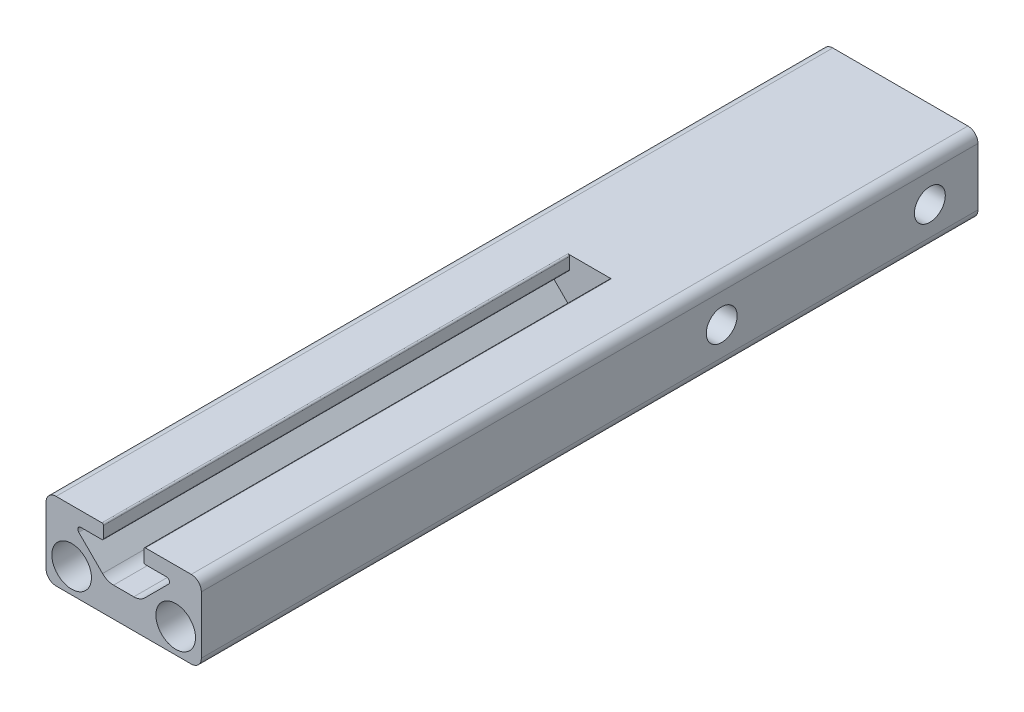
ISO-10303-21;
HEADER;
FILE_DESCRIPTION(('STEP AP214'),'2;1');
FILE_NAME('part.step','',(''),(''),'','','');
FILE_SCHEMA(('AUTOMOTIVE_DESIGN { 1 0 10303 214 1 1 1 1 }'));
ENDSEC;
DATA;
#1=APPLICATION_CONTEXT('core data for automotive mechanical design processes');
#2=APPLICATION_PROTOCOL_DEFINITION('international standard','automotive_design',2000,#1);
#3=PRODUCT_CONTEXT('',#1,'mechanical');
#4=PRODUCT('Part','Part','',(#3));
#5=PRODUCT_RELATED_PRODUCT_CATEGORY('part','',(#4));
#6=PRODUCT_DEFINITION_FORMATION('','',#4);
#7=PRODUCT_DEFINITION_CONTEXT('part definition',#1,'design');
#8=PRODUCT_DEFINITION('design','',#6,#7);
#9=PRODUCT_DEFINITION_SHAPE('','',#8);
#10=(LENGTH_UNIT() NAMED_UNIT(*) SI_UNIT(.MILLI.,.METRE.));
#11=(NAMED_UNIT(*) PLANE_ANGLE_UNIT() SI_UNIT($,.RADIAN.));
#12=(NAMED_UNIT(*) SI_UNIT($,.STERADIAN.) SOLID_ANGLE_UNIT());
#13=UNCERTAINTY_MEASURE_WITH_UNIT(LENGTH_MEASURE(1.E-05),#10,'distance_accuracy_value','');
#14=(GEOMETRIC_REPRESENTATION_CONTEXT(3) GLOBAL_UNCERTAINTY_ASSIGNED_CONTEXT((#13)) GLOBAL_UNIT_ASSIGNED_CONTEXT((#10,
#11,#12)) REPRESENTATION_CONTEXT('',''));
#15=CARTESIAN_POINT('',(0.,0.,0.));
#16=DIRECTION('',(0.,0.,1.));
#17=DIRECTION('',(1.,0.,0.));
#18=AXIS2_PLACEMENT_3D('',#15,#16,#17);
#19=CARTESIAN_POINT('',(-11.049,11.049,38.1));
#20=DIRECTION('',(0.,0.,1.));
#21=DIRECTION('',(1.,0.,0.));
#22=AXIS2_PLACEMENT_3D('',#19,#20,#21);
#23=PLANE('',#22);
#24=CARTESIAN_POINT('',(8.509,4.064,38.1));
#25=DIRECTION('',(0.,0.,1.));
#26=DIRECTION('',(1.,0.,0.));
#27=AXIS2_PLACEMENT_3D('',#24,#25,#26);
#28=CIRCLE('',#27,3.2385);
#29=CARTESIAN_POINT('',(11.7475,4.064,38.1));
#30=VERTEX_POINT('',#29);
#31=EDGE_CURVE('E270',#30,#30,#28,.T.);
#32=ORIENTED_EDGE('',*,*,#31,.F.);
#33=EDGE_LOOP('',(#32));
#34=FACE_BOUND('',#33,.T.);
#35=DIRECTION('',(0.,-1.,0.));
#36=VECTOR('',#35,1.);
#37=CARTESIAN_POINT('',(3.302,12.7,38.1));
#38=LINE('',#37,#36);
#39=CARTESIAN_POINT('',(3.302,12.446,38.1));
#40=VERTEX_POINT('',#39);
#41=CARTESIAN_POINT('',(3.302,10.582863886556,38.1));
#42=VERTEX_POINT('',#41);
#43=EDGE_CURVE('E304',#40,#42,#38,.T.);
#44=ORIENTED_EDGE('',*,*,#43,.T.);
#45=CARTESIAN_POINT('',(3.556,10.582863886556,38.1));
#46=DIRECTION('',(0.,0.,1.));
#47=DIRECTION('',(1.,0.,0.));
#48=AXIS2_PLACEMENT_3D('',#45,#46,#47);
#49=CIRCLE('',#48,0.254);
#50=CARTESIAN_POINT('',(3.556,10.328863886556,38.1));
#51=VERTEX_POINT('',#50);
#52=EDGE_CURVE('E465',#42,#51,#49,.T.);
#53=ORIENTED_EDGE('',*,*,#52,.T.);
#54=DIRECTION('',(1.,0.,0.));
#55=VECTOR('',#54,1.);
#56=CARTESIAN_POINT('',(3.302,10.328863886556,38.1));
#57=LINE('',#56,#55);
#58=CARTESIAN_POINT('',(6.985,10.328863886556,38.1));
#59=VERTEX_POINT('',#58);
#60=EDGE_CURVE('E308',#51,#59,#57,.T.);
#61=ORIENTED_EDGE('',*,*,#60,.T.);
#62=CARTESIAN_POINT('',(6.985,9.82086388655604,38.1));
#63=DIRECTION('',(0.,0.,-1.));
#64=DIRECTION('',(1.,0.,0.));
#65=AXIS2_PLACEMENT_3D('',#62,#63,#64);
#66=CIRCLE('',#65,0.508);
#67=CARTESIAN_POINT('',(7.34421024484277,9.46165364171327,38.1));
#68=VERTEX_POINT('',#67);
#69=EDGE_CURVE('E311',#59,#68,#66,.T.);
#70=ORIENTED_EDGE('',*,*,#69,.T.);
#71=DIRECTION('',(-0.707106781186546,-0.707106781186549,0.));
#72=VECTOR('',#71,1.);
#73=CARTESIAN_POINT('',(7.34421024484277,9.46165364171327,38.1));
#74=LINE('',#73,#72);
#75=CARTESIAN_POINT('',(3.45250537891568,5.56994877578617,38.1));
#76=VERTEX_POINT('',#75);
#77=EDGE_CURVE('E314',#68,#76,#74,.T.);
#78=ORIENTED_EDGE('',*,*,#77,.T.);
#79=CARTESIAN_POINT('',(1.65645415470184,7.366,38.1));
#80=DIRECTION('',(0.,0.,-1.));
#81=DIRECTION('',(1.,0.,0.));
#82=AXIS2_PLACEMENT_3D('',#79,#80,#81);
#83=CIRCLE('',#82,2.54);
#84=CARTESIAN_POINT('',(1.65645415470184,4.826,38.1));
#85=VERTEX_POINT('',#84);
#86=EDGE_CURVE('E317',#76,#85,#83,.T.);
#87=ORIENTED_EDGE('',*,*,#86,.T.);
#88=DIRECTION('',(-1.,0.,0.));
#89=VECTOR('',#88,1.);
#90=CARTESIAN_POINT('',(1.65645415470184,4.826,38.1));
#91=LINE('',#90,#89);
#92=CARTESIAN_POINT('',(-1.65645415470184,4.826,38.1));
#93=VERTEX_POINT('',#92);
#94=EDGE_CURVE('E320',#85,#93,#91,.T.);
#95=ORIENTED_EDGE('',*,*,#94,.T.);
#96=CARTESIAN_POINT('',(-1.65645415470184,7.366,38.1));
#97=DIRECTION('',(0.,0.,-1.));
#98=DIRECTION('',(1.,0.,0.));
#99=AXIS2_PLACEMENT_3D('',#96,#97,#98);
#100=CIRCLE('',#99,2.54);
#101=CARTESIAN_POINT('',(-3.45250537891568,5.56994877578617,38.1));
#102=VERTEX_POINT('',#101);
#103=EDGE_CURVE('E323',#93,#102,#100,.T.);
#104=ORIENTED_EDGE('',*,*,#103,.T.);
#105=DIRECTION('',(-0.707106781186546,0.707106781186549,0.));
#106=VECTOR('',#105,1.);
#107=CARTESIAN_POINT('',(-3.45250537891568,5.56994877578617,38.1));
#108=LINE('',#107,#106);
#109=CARTESIAN_POINT('',(-7.34421024484277,9.46165364171327,38.1));
#110=VERTEX_POINT('',#109);
#111=EDGE_CURVE('E326',#102,#110,#108,.T.);
#112=ORIENTED_EDGE('',*,*,#111,.T.);
#113=CARTESIAN_POINT('',(-6.985,9.82086388655604,38.1));
#114=DIRECTION('',(0.,0.,-1.));
#115=DIRECTION('',(1.,0.,0.));
#116=AXIS2_PLACEMENT_3D('',#113,#114,#115);
#117=CIRCLE('',#116,0.507999999999999);
#118=CARTESIAN_POINT('',(-6.985,10.328863886556,38.1));
#119=VERTEX_POINT('',#118);
#120=EDGE_CURVE('E329',#110,#119,#117,.T.);
#121=ORIENTED_EDGE('',*,*,#120,.T.);
#122=DIRECTION('',(1.,0.,0.));
#123=VECTOR('',#122,1.);
#124=CARTESIAN_POINT('',(-6.985,10.328863886556,38.1));
#125=LINE('',#124,#123);
#126=CARTESIAN_POINT('',(-3.556,10.328863886556,38.1));
#127=VERTEX_POINT('',#126);
#128=EDGE_CURVE('E332',#119,#127,#125,.T.);
#129=ORIENTED_EDGE('',*,*,#128,.T.);
#130=CARTESIAN_POINT('',(-3.556,10.582863886556,38.1));
#131=DIRECTION('',(0.,0.,1.));
#132=DIRECTION('',(1.,0.,0.));
#133=AXIS2_PLACEMENT_3D('',#130,#131,#132);
#134=CIRCLE('',#133,0.254);
#135=CARTESIAN_POINT('',(-3.302,10.582863886556,38.1));
#136=VERTEX_POINT('',#135);
#137=EDGE_CURVE('E459',#127,#136,#134,.T.);
#138=ORIENTED_EDGE('',*,*,#137,.T.);
#139=DIRECTION('',(0.,1.,0.));
#140=VECTOR('',#139,1.);
#141=CARTESIAN_POINT('',(-3.302,12.7,38.1));
#142=LINE('',#141,#140);
#143=CARTESIAN_POINT('',(-3.302,12.446,38.1));
#144=VERTEX_POINT('',#143);
#145=EDGE_CURVE('E336',#136,#144,#142,.T.);
#146=ORIENTED_EDGE('',*,*,#145,.T.);
#147=CARTESIAN_POINT('',(-3.556,12.446,38.1));
#148=DIRECTION('',(0.,0.,1.));
#149=DIRECTION('',(1.,0.,0.));
#150=AXIS2_PLACEMENT_3D('',#147,#148,#149);
#151=CIRCLE('',#150,0.254);
#152=CARTESIAN_POINT('',(-3.556,12.7,38.1));
#153=VERTEX_POINT('',#152);
#154=EDGE_CURVE('E55',#144,#153,#151,.T.);
#155=ORIENTED_EDGE('',*,*,#154,.T.);
#156=DIRECTION('',(-1.,0.,0.));
#157=VECTOR('',#156,1.);
#158=CARTESIAN_POINT('',(-11.049,12.7,38.1));
#159=LINE('',#158,#157);
#160=CARTESIAN_POINT('',(-11.049,12.7,38.1));
#161=VERTEX_POINT('',#160);
#162=EDGE_CURVE('E339',#153,#161,#159,.T.);
#163=ORIENTED_EDGE('',*,*,#162,.T.);
#164=CARTESIAN_POINT('',(-11.049,11.049,38.1));
#165=DIRECTION('',(0.,0.,1.));
#166=DIRECTION('',(1.,0.,0.));
#167=AXIS2_PLACEMENT_3D('',#164,#165,#166);
#168=CIRCLE('',#167,1.651);
#169=CARTESIAN_POINT('',(-12.7,11.049,38.1));
#170=VERTEX_POINT('',#169);
#171=EDGE_CURVE('E278',#161,#170,#168,.T.);
#172=ORIENTED_EDGE('',*,*,#171,.T.);
#173=DIRECTION('',(0.,-1.,0.));
#174=VECTOR('',#173,1.);
#175=CARTESIAN_POINT('',(-12.7,11.049,38.1));
#176=LINE('',#175,#174);
#177=CARTESIAN_POINT('',(-12.7,1.65099999999999,38.1));
#178=VERTEX_POINT('',#177);
#179=EDGE_CURVE('E282',#170,#178,#176,.T.);
#180=ORIENTED_EDGE('',*,*,#179,.T.);
#181=CARTESIAN_POINT('',(-11.049,1.65099999999999,38.1));
#182=DIRECTION('',(0.,0.,1.));
#183=DIRECTION('',(1.,0.,0.));
#184=AXIS2_PLACEMENT_3D('',#181,#182,#183);
#185=CIRCLE('',#184,1.651);
#186=CARTESIAN_POINT('',(-11.049,0.,38.1));
#187=VERTEX_POINT('',#186);
#188=EDGE_CURVE('E286',#178,#187,#185,.T.);
#189=ORIENTED_EDGE('',*,*,#188,.T.);
#190=DIRECTION('',(1.,0.,0.));
#191=VECTOR('',#190,1.);
#192=CARTESIAN_POINT('',(11.049,0.,38.1));
#193=LINE('',#192,#191);
#194=CARTESIAN_POINT('',(11.049,0.,38.1));
#195=VERTEX_POINT('',#194);
#196=EDGE_CURVE('E289',#187,#195,#193,.T.);
#197=ORIENTED_EDGE('',*,*,#196,.T.);
#198=CARTESIAN_POINT('',(11.049,1.651,38.1));
#199=DIRECTION('',(0.,0.,1.));
#200=DIRECTION('',(1.,0.,0.));
#201=AXIS2_PLACEMENT_3D('',#198,#199,#200);
#202=CIRCLE('',#201,1.651);
#203=CARTESIAN_POINT('',(12.7,1.651,38.1));
#204=VERTEX_POINT('',#203);
#205=EDGE_CURVE('E292',#195,#204,#202,.T.);
#206=ORIENTED_EDGE('',*,*,#205,.T.);
#207=DIRECTION('',(0.,1.,0.));
#208=VECTOR('',#207,1.);
#209=CARTESIAN_POINT('',(12.7,1.651,38.1));
#210=LINE('',#209,#208);
#211=CARTESIAN_POINT('',(12.7,11.049,38.1));
#212=VERTEX_POINT('',#211);
#213=EDGE_CURVE('E295',#204,#212,#210,.T.);
#214=ORIENTED_EDGE('',*,*,#213,.T.);
#215=CARTESIAN_POINT('',(11.049,11.049,38.1));
#216=DIRECTION('',(0.,0.,1.));
#217=DIRECTION('',(1.,0.,0.));
#218=AXIS2_PLACEMENT_3D('',#215,#216,#217);
#219=CIRCLE('',#218,1.651);
#220=CARTESIAN_POINT('',(11.049,12.7,38.1));
#221=VERTEX_POINT('',#220);
#222=EDGE_CURVE('E210',#212,#221,#219,.T.);
#223=ORIENTED_EDGE('',*,*,#222,.T.);
#224=DIRECTION('',(-1.,0.,0.));
#225=VECTOR('',#224,1.);
#226=CARTESIAN_POINT('',(3.302,12.7,38.1));
#227=LINE('',#226,#225);
#228=CARTESIAN_POINT('',(3.556,12.7,38.1));
#229=VERTEX_POINT('',#228);
#230=EDGE_CURVE('E300',#221,#229,#227,.T.);
#231=ORIENTED_EDGE('',*,*,#230,.T.);
#232=CARTESIAN_POINT('',(3.556,12.446,38.1));
#233=DIRECTION('',(0.,0.,1.));
#234=DIRECTION('',(1.,0.,0.));
#235=AXIS2_PLACEMENT_3D('',#232,#233,#234);
#236=CIRCLE('',#235,0.254);
#237=EDGE_CURVE('E462',#229,#40,#236,.T.);
#238=ORIENTED_EDGE('',*,*,#237,.T.);
#239=EDGE_LOOP('',(#44,#53,#61,#70,#78,#87,#95,#104,#112,#121,#129,#138,#146,#155,#163,#172,
#180,#189,#197,#206,#214,#223,#231,#238));
#240=FACE_BOUND('',#239,.T.);
#241=CARTESIAN_POINT('',(-8.509,4.064,38.1));
#242=DIRECTION('',(0.,0.,1.));
#243=DIRECTION('',(1.,0.,0.));
#244=AXIS2_PLACEMENT_3D('',#241,#242,#243);
#245=CIRCLE('',#244,3.2385);
#246=CARTESIAN_POINT('',(-5.2705,4.064,38.1));
#247=VERTEX_POINT('',#246);
#248=EDGE_CURVE('E262',#247,#247,#245,.T.);
#249=ORIENTED_EDGE('',*,*,#248,.F.);
#250=EDGE_LOOP('',(#249));
#251=FACE_BOUND('',#250,.T.);
#252=ADVANCED_FACE('F39',(#34,#240,#251),#23,.T.);
#253=CARTESIAN_POINT('',(-11.049,11.049,38.1));
#254=DIRECTION('',(0.,0.,-1.));
#255=DIRECTION('',(-1.,0.,0.));
#256=AXIS2_PLACEMENT_3D('',#253,#254,#255);
#257=CYLINDRICAL_SURFACE('',#256,1.651);
#258=DIRECTION('',(0.,0.,-1.));
#259=VECTOR('',#258,1.);
#260=CARTESIAN_POINT('',(-11.049,12.7,38.1));
#261=LINE('',#260,#259);
#262=CARTESIAN_POINT('',(-11.049,12.7,-88.9));
#263=VERTEX_POINT('',#262);
#264=EDGE_CURVE('E342',#161,#263,#261,.T.);
#265=ORIENTED_EDGE('',*,*,#264,.T.);
#266=CARTESIAN_POINT('',(-11.049,11.049,-88.9));
#267=DIRECTION('',(0.,0.,-1.));
#268=DIRECTION('',(-1.,0.,0.));
#269=AXIS2_PLACEMENT_3D('',#266,#267,#268);
#270=CIRCLE('',#269,1.651);
#271=CARTESIAN_POINT('',(-12.7,11.049,-88.9));
#272=VERTEX_POINT('',#271);
#273=EDGE_CURVE('E256',#272,#263,#270,.T.);
#274=ORIENTED_EDGE('',*,*,#273,.F.);
#275=DIRECTION('',(0.,0.,-1.));
#276=VECTOR('',#275,1.);
#277=CARTESIAN_POINT('',(-12.7,11.049,38.1));
#278=LINE('',#277,#276);
#279=EDGE_CURVE('E431',#170,#272,#278,.T.);
#280=ORIENTED_EDGE('',*,*,#279,.F.);
#281=ORIENTED_EDGE('',*,*,#171,.F.);
#282=EDGE_LOOP('',(#265,#274,#280,#281));
#283=FACE_BOUND('',#282,.T.);
#284=ADVANCED_FACE('F502',(#283),#257,.T.);
#285=CARTESIAN_POINT('',(-12.7,11.049,38.1));
#286=DIRECTION('',(1.,0.,0.));
#287=DIRECTION('',(0.,0.,-1.));
#288=AXIS2_PLACEMENT_3D('',#285,#286,#287);
#289=PLANE('',#288);
#290=CARTESIAN_POINT('',(-12.7,6.35,-46.99));
#291=DIRECTION('',(1.,0.,0.));
#292=DIRECTION('',(0.,0.,-1.));
#293=AXIS2_PLACEMENT_3D('',#290,#291,#292);
#294=CIRCLE('',#293,2.52729999999999);
#295=CARTESIAN_POINT('',(-12.7,6.35,-49.5173));
#296=VERTEX_POINT('',#295);
#297=EDGE_CURVE('E701',#296,#296,#294,.T.);
#298=ORIENTED_EDGE('',*,*,#297,.T.);
#299=EDGE_LOOP('',(#298));
#300=FACE_BOUND('',#299,.T.);
#301=CARTESIAN_POINT('',(-12.7,6.35,-81.026));
#302=DIRECTION('',(1.,0.,0.));
#303=DIRECTION('',(0.,0.,-1.));
#304=AXIS2_PLACEMENT_3D('',#301,#302,#303);
#305=CIRCLE('',#304,2.52729999999999);
#306=CARTESIAN_POINT('',(-12.7,6.35,-83.5533));
#307=VERTEX_POINT('',#306);
#308=EDGE_CURVE('E237',#307,#307,#305,.T.);
#309=ORIENTED_EDGE('',*,*,#308,.T.);
#310=EDGE_LOOP('',(#309));
#311=FACE_BOUND('',#310,.T.);
#312=ORIENTED_EDGE('',*,*,#279,.T.);
#313=DIRECTION('',(0.,1.,0.));
#314=VECTOR('',#313,1.);
#315=CARTESIAN_POINT('',(-12.7,1.65099999999999,-88.9));
#316=LINE('',#315,#314);
#317=CARTESIAN_POINT('',(-12.7,1.65099999999999,-88.9));
#318=VERTEX_POINT('',#317);
#319=EDGE_CURVE('E252',#318,#272,#316,.T.);
#320=ORIENTED_EDGE('',*,*,#319,.F.);
#321=DIRECTION('',(0.,0.,-1.));
#322=VECTOR('',#321,1.);
#323=CARTESIAN_POINT('',(-12.7,1.65099999999999,38.1));
#324=LINE('',#323,#322);
#325=EDGE_CURVE('E428',#178,#318,#324,.T.);
#326=ORIENTED_EDGE('',*,*,#325,.F.);
#327=ORIENTED_EDGE('',*,*,#179,.F.);
#328=EDGE_LOOP('',(#312,#320,#326,#327));
#329=FACE_BOUND('',#328,.T.);
#330=ADVANCED_FACE('F505',(#300,#311,#329),#289,.F.);
#331=CARTESIAN_POINT('',(-11.049,1.65099999999999,38.1));
#332=DIRECTION('',(0.,0.,-1.));
#333=DIRECTION('',(-1.,0.,0.));
#334=AXIS2_PLACEMENT_3D('',#331,#332,#333);
#335=CYLINDRICAL_SURFACE('',#334,1.651);
#336=ORIENTED_EDGE('',*,*,#325,.T.);
#337=CARTESIAN_POINT('',(-11.049,1.65099999999999,-88.9));
#338=DIRECTION('',(0.,0.,-1.));
#339=DIRECTION('',(-1.,0.,0.));
#340=AXIS2_PLACEMENT_3D('',#337,#338,#339);
#341=CIRCLE('',#340,1.651);
#342=CARTESIAN_POINT('',(-11.049,0.,-88.9));
#343=VERTEX_POINT('',#342);
#344=EDGE_CURVE('E248',#343,#318,#341,.T.);
#345=ORIENTED_EDGE('',*,*,#344,.F.);
#346=DIRECTION('',(0.,0.,-1.));
#347=VECTOR('',#346,1.);
#348=CARTESIAN_POINT('',(-11.049,0.,38.1));
#349=LINE('',#348,#347);
#350=EDGE_CURVE('E425',#187,#343,#349,.T.);
#351=ORIENTED_EDGE('',*,*,#350,.F.);
#352=ORIENTED_EDGE('',*,*,#188,.F.);
#353=EDGE_LOOP('',(#336,#345,#351,#352));
#354=FACE_BOUND('',#353,.T.);
#355=ADVANCED_FACE('F510',(#354),#335,.T.);
#356=CARTESIAN_POINT('',(11.049,0.,38.1));
#357=DIRECTION('',(0.,1.,0.));
#358=DIRECTION('',(-1.,0.,0.));
#359=AXIS2_PLACEMENT_3D('',#356,#357,#358);
#360=PLANE('',#359);
#361=ORIENTED_EDGE('',*,*,#350,.T.);
#362=DIRECTION('',(-1.,0.,0.));
#363=VECTOR('',#362,1.);
#364=CARTESIAN_POINT('',(11.049,0.,-88.9));
#365=LINE('',#364,#363);
#366=CARTESIAN_POINT('',(11.049,0.,-88.9));
#367=VERTEX_POINT('',#366);
#368=EDGE_CURVE('E244',#367,#343,#365,.T.);
#369=ORIENTED_EDGE('',*,*,#368,.F.);
#370=DIRECTION('',(0.,0.,-1.));
#371=VECTOR('',#370,1.);
#372=CARTESIAN_POINT('',(11.049,0.,38.1));
#373=LINE('',#372,#371);
#374=EDGE_CURVE('E422',#195,#367,#373,.T.);
#375=ORIENTED_EDGE('',*,*,#374,.F.);
#376=ORIENTED_EDGE('',*,*,#196,.F.);
#377=EDGE_LOOP('',(#361,#369,#375,#376));
#378=FACE_BOUND('',#377,.T.);
#379=ADVANCED_FACE('F516',(#378),#360,.F.);
#380=CARTESIAN_POINT('',(11.049,1.651,38.1));
#381=DIRECTION('',(0.,0.,-1.));
#382=DIRECTION('',(-1.,0.,0.));
#383=AXIS2_PLACEMENT_3D('',#380,#381,#382);
#384=CYLINDRICAL_SURFACE('',#383,1.651);
#385=ORIENTED_EDGE('',*,*,#374,.T.);
#386=CARTESIAN_POINT('',(11.049,1.651,-88.9));
#387=DIRECTION('',(0.,0.,-1.));
#388=DIRECTION('',(-1.,0.,0.));
#389=AXIS2_PLACEMENT_3D('',#386,#387,#388);
#390=CIRCLE('',#389,1.651);
#391=CARTESIAN_POINT('',(12.7,1.651,-88.9));
#392=VERTEX_POINT('',#391);
#393=EDGE_CURVE('E225',#392,#367,#390,.T.);
#394=ORIENTED_EDGE('',*,*,#393,.F.);
#395=DIRECTION('',(0.,0.,-1.));
#396=VECTOR('',#395,1.);
#397=CARTESIAN_POINT('',(12.7,1.651,38.1));
#398=LINE('',#397,#396);
#399=EDGE_CURVE('E214',#204,#392,#398,.T.);
#400=ORIENTED_EDGE('',*,*,#399,.F.);
#401=ORIENTED_EDGE('',*,*,#205,.F.);
#402=EDGE_LOOP('',(#385,#394,#400,#401));
#403=FACE_BOUND('',#402,.T.);
#404=ADVANCED_FACE('F518',(#403),#384,.T.);
#405=CARTESIAN_POINT('',(12.7,1.651,38.1));
#406=DIRECTION('',(-1.,0.,0.));
#407=DIRECTION('',(0.,0.,1.));
#408=AXIS2_PLACEMENT_3D('',#405,#406,#407);
#409=PLANE('',#408);
#410=CARTESIAN_POINT('',(12.7,6.35,-46.99));
#411=DIRECTION('',(1.,0.,0.));
#412=DIRECTION('',(0.,0.,-1.));
#413=AXIS2_PLACEMENT_3D('',#410,#411,#412);
#414=CIRCLE('',#413,2.5273);
#415=CARTESIAN_POINT('',(12.7,6.35,-49.5173));
#416=VERTEX_POINT('',#415);
#417=EDGE_CURVE('E704',#416,#416,#414,.T.);
#418=ORIENTED_EDGE('',*,*,#417,.F.);
#419=EDGE_LOOP('',(#418));
#420=FACE_BOUND('',#419,.T.);
#421=CARTESIAN_POINT('',(12.7,6.35,-81.026));
#422=DIRECTION('',(1.,0.,0.));
#423=DIRECTION('',(0.,0.,-1.));
#424=AXIS2_PLACEMENT_3D('',#421,#422,#423);
#425=CIRCLE('',#424,2.5273);
#426=CARTESIAN_POINT('',(12.7,6.35,-83.5533));
#427=VERTEX_POINT('',#426);
#428=EDGE_CURVE('E706',#427,#427,#425,.T.);
#429=ORIENTED_EDGE('',*,*,#428,.F.);
#430=EDGE_LOOP('',(#429));
#431=FACE_BOUND('',#430,.T.);
#432=ORIENTED_EDGE('',*,*,#399,.T.);
#433=DIRECTION('',(0.,-1.,0.));
#434=VECTOR('',#433,1.);
#435=CARTESIAN_POINT('',(12.7,11.049,-88.9));
#436=LINE('',#435,#434);
#437=CARTESIAN_POINT('',(12.7,11.049,-88.9));
#438=VERTEX_POINT('',#437);
#439=EDGE_CURVE('E218',#438,#392,#436,.T.);
#440=ORIENTED_EDGE('',*,*,#439,.F.);
#441=DIRECTION('',(0.,0.,-1.));
#442=VECTOR('',#441,1.);
#443=CARTESIAN_POINT('',(12.7,11.049,38.1));
#444=LINE('',#443,#442);
#445=EDGE_CURVE('E204',#212,#438,#444,.T.);
#446=ORIENTED_EDGE('',*,*,#445,.F.);
#447=ORIENTED_EDGE('',*,*,#213,.F.);
#448=EDGE_LOOP('',(#432,#440,#446,#447));
#449=FACE_BOUND('',#448,.T.);
#450=ADVANCED_FACE('F219',(#420,#431,#449),#409,.F.);
#451=CARTESIAN_POINT('',(11.049,11.049,38.1));
#452=DIRECTION('',(0.,0.,-1.));
#453=DIRECTION('',(-1.,0.,0.));
#454=AXIS2_PLACEMENT_3D('',#451,#452,#453);
#455=CYLINDRICAL_SURFACE('',#454,1.651);
#456=ORIENTED_EDGE('',*,*,#445,.T.);
#457=CARTESIAN_POINT('',(11.049,11.049,-88.9));
#458=DIRECTION('',(0.,0.,-1.));
#459=DIRECTION('',(-1.,0.,0.));
#460=AXIS2_PLACEMENT_3D('',#457,#458,#459);
#461=CIRCLE('',#460,1.651);
#462=CARTESIAN_POINT('',(11.049,12.7,-88.9));
#463=VERTEX_POINT('',#462);
#464=EDGE_CURVE('E209',#463,#438,#461,.T.);
#465=ORIENTED_EDGE('',*,*,#464,.F.);
#466=DIRECTION('',(0.,0.,-1.));
#467=VECTOR('',#466,1.);
#468=CARTESIAN_POINT('',(11.049,12.7,38.1));
#469=LINE('',#468,#467);
#470=EDGE_CURVE('E215',#221,#463,#469,.T.);
#471=ORIENTED_EDGE('',*,*,#470,.F.);
#472=ORIENTED_EDGE('',*,*,#222,.F.);
#473=EDGE_LOOP('',(#456,#465,#471,#472));
#474=FACE_BOUND('',#473,.T.);
#475=ADVANCED_FACE('F206',(#474),#455,.T.);
#476=CARTESIAN_POINT('',(3.302,12.7,38.1));
#477=DIRECTION('',(1.,0.,0.));
#478=DIRECTION('',(0.,1.,0.));
#479=AXIS2_PLACEMENT_3D('',#476,#477,#478);
#480=PLANE('',#479);
#481=DIRECTION('',(0.,-1.,0.));
#482=VECTOR('',#481,1.);
#483=CARTESIAN_POINT('',(3.302,12.7,-38.1));
#484=LINE('',#483,#482);
#485=CARTESIAN_POINT('',(3.302,12.446,-38.1));
#486=VERTEX_POINT('',#485);
#487=CARTESIAN_POINT('',(3.302,10.582863886556,-38.1));
#488=VERTEX_POINT('',#487);
#489=EDGE_CURVE('E274',#486,#488,#484,.T.);
#490=ORIENTED_EDGE('',*,*,#489,.T.);
#491=DIRECTION('',(0.,0.,-1.));
#492=VECTOR('',#491,1.);
#493=CARTESIAN_POINT('',(3.302,10.582863886556,38.1));
#494=LINE('',#493,#492);
#495=EDGE_CURVE('E454',#488,#42,#494,.F.);
#496=ORIENTED_EDGE('',*,*,#495,.T.);
#497=ORIENTED_EDGE('',*,*,#43,.F.);
#498=DIRECTION('',(0.,0.,-1.));
#499=VECTOR('',#498,1.);
#500=CARTESIAN_POINT('',(3.302,12.446,38.1));
#501=LINE('',#500,#499);
#502=EDGE_CURVE('E450',#40,#486,#501,.T.);
#503=ORIENTED_EDGE('',*,*,#502,.T.);
#504=EDGE_LOOP('',(#490,#496,#497,#503));
#505=FACE_BOUND('',#504,.T.);
#506=ADVANCED_FACE('F528',(#505),#480,.F.);
#507=CARTESIAN_POINT('',(3.302,10.328863886556,38.1));
#508=DIRECTION('',(0.,1.,0.));
#509=DIRECTION('',(0.,0.,1.));
#510=AXIS2_PLACEMENT_3D('',#507,#508,#509);
#511=PLANE('',#510);
#512=ORIENTED_EDGE('',*,*,#60,.F.);
#513=DIRECTION('',(0.,0.,-1.));
#514=VECTOR('',#513,1.);
#515=CARTESIAN_POINT('',(3.556,10.328863886556,38.1));
#516=LINE('',#515,#514);
#517=CARTESIAN_POINT('',(3.556,10.328863886556,-38.1));
#518=VERTEX_POINT('',#517);
#519=EDGE_CURVE('E434',#51,#518,#516,.T.);
#520=ORIENTED_EDGE('',*,*,#519,.T.);
#521=DIRECTION('',(1.,0.,0.));
#522=VECTOR('',#521,1.);
#523=CARTESIAN_POINT('',(3.302,10.328863886556,-38.1));
#524=LINE('',#523,#522);
#525=CARTESIAN_POINT('',(6.985,10.328863886556,-38.1));
#526=VERTEX_POINT('',#525);
#527=EDGE_CURVE('E346',#518,#526,#524,.T.);
#528=ORIENTED_EDGE('',*,*,#527,.T.);
#529=DIRECTION('',(0.,0.,-1.));
#530=VECTOR('',#529,1.);
#531=CARTESIAN_POINT('',(6.985,10.328863886556,38.1));
#532=LINE('',#531,#530);
#533=EDGE_CURVE('E414',#59,#526,#532,.T.);
#534=ORIENTED_EDGE('',*,*,#533,.F.);
#535=EDGE_LOOP('',(#512,#520,#528,#534));
#536=FACE_BOUND('',#535,.T.);
#537=ADVANCED_FACE('F537',(#536),#511,.F.);
#538=CARTESIAN_POINT('',(6.985,9.82086388655604,38.1));
#539=DIRECTION('',(0.,0.,-1.));
#540=DIRECTION('',(-1.,0.,0.));
#541=AXIS2_PLACEMENT_3D('',#538,#539,#540);
#542=CYLINDRICAL_SURFACE('',#541,0.508);
#543=CARTESIAN_POINT('',(6.985,9.82086388655604,-38.1));
#544=DIRECTION('',(0.,0.,-1.));
#545=DIRECTION('',(1.,0.,0.));
#546=AXIS2_PLACEMENT_3D('',#543,#544,#545);
#547=CIRCLE('',#546,0.508);
#548=CARTESIAN_POINT('',(7.34421024484277,9.46165364171327,-38.1));
#549=VERTEX_POINT('',#548);
#550=EDGE_CURVE('E350',#526,#549,#547,.T.);
#551=ORIENTED_EDGE('',*,*,#550,.T.);
#552=DIRECTION('',(0.,0.,-1.));
#553=VECTOR('',#552,1.);
#554=CARTESIAN_POINT('',(7.34421024484277,9.46165364171327,38.1));
#555=LINE('',#554,#553);
#556=EDGE_CURVE('E410',#68,#549,#555,.T.);
#557=ORIENTED_EDGE('',*,*,#556,.F.);
#558=ORIENTED_EDGE('',*,*,#69,.F.);
#559=ORIENTED_EDGE('',*,*,#533,.T.);
#560=EDGE_LOOP('',(#551,#557,#558,#559));
#561=FACE_BOUND('',#560,.T.);
#562=ADVANCED_FACE('F541',(#561),#542,.F.);
#563=CARTESIAN_POINT('',(7.34421024484277,9.46165364171327,38.1));
#564=DIRECTION('',(0.707106781186549,-0.707106781186546,0.));
#565=DIRECTION('',(0.707106781186546,0.707106781186549,0.));
#566=AXIS2_PLACEMENT_3D('',#563,#564,#565);
#567=PLANE('',#566);
#568=DIRECTION('',(-0.707106781186546,-0.707106781186549,0.));
#569=VECTOR('',#568,1.);
#570=CARTESIAN_POINT('',(7.34421024484277,9.46165364171327,-38.1));
#571=LINE('',#570,#569);
#572=CARTESIAN_POINT('',(3.45250537891568,5.56994877578617,-38.1));
#573=VERTEX_POINT('',#572);
#574=EDGE_CURVE('E354',#549,#573,#571,.T.);
#575=ORIENTED_EDGE('',*,*,#574,.T.);
#576=DIRECTION('',(0.,0.,-1.));
#577=VECTOR('',#576,1.);
#578=CARTESIAN_POINT('',(3.45250537891568,5.56994877578617,38.1));
#579=LINE('',#578,#577);
#580=EDGE_CURVE('E406',#76,#573,#579,.T.);
#581=ORIENTED_EDGE('',*,*,#580,.F.);
#582=ORIENTED_EDGE('',*,*,#77,.F.);
#583=ORIENTED_EDGE('',*,*,#556,.T.);
#584=EDGE_LOOP('',(#575,#581,#582,#583));
#585=FACE_BOUND('',#584,.T.);
#586=ADVANCED_FACE('F547',(#585),#567,.F.);
#587=CARTESIAN_POINT('',(1.65645415470184,7.366,38.1));
#588=DIRECTION('',(0.,0.,-1.));
#589=DIRECTION('',(-1.,0.,0.));
#590=AXIS2_PLACEMENT_3D('',#587,#588,#589);
#591=CYLINDRICAL_SURFACE('',#590,2.54);
#592=CARTESIAN_POINT('',(1.65645415470184,7.366,-38.1));
#593=DIRECTION('',(0.,0.,-1.));
#594=DIRECTION('',(1.,0.,0.));
#595=AXIS2_PLACEMENT_3D('',#592,#593,#594);
#596=CIRCLE('',#595,2.54);
#597=CARTESIAN_POINT('',(1.65645415470184,4.826,-38.1));
#598=VERTEX_POINT('',#597);
#599=EDGE_CURVE('E358',#573,#598,#596,.T.);
#600=ORIENTED_EDGE('',*,*,#599,.T.);
#601=DIRECTION('',(0.,0.,-1.));
#602=VECTOR('',#601,1.);
#603=CARTESIAN_POINT('',(1.65645415470184,4.826,38.1));
#604=LINE('',#603,#602);
#605=EDGE_CURVE('E402',#85,#598,#604,.T.);
#606=ORIENTED_EDGE('',*,*,#605,.F.);
#607=ORIENTED_EDGE('',*,*,#86,.F.);
#608=ORIENTED_EDGE('',*,*,#580,.T.);
#609=EDGE_LOOP('',(#600,#606,#607,#608));
#610=FACE_BOUND('',#609,.T.);
#611=ADVANCED_FACE('F549',(#610),#591,.F.);
#612=CARTESIAN_POINT('',(1.65645415470184,4.826,38.1));
#613=DIRECTION('',(0.,-1.,0.));
#614=DIRECTION('',(1.,0.,0.));
#615=AXIS2_PLACEMENT_3D('',#612,#613,#614);
#616=PLANE('',#615);
#617=DIRECTION('',(-1.,0.,0.));
#618=VECTOR('',#617,1.);
#619=CARTESIAN_POINT('',(1.65645415470184,4.826,-38.1));
#620=LINE('',#619,#618);
#621=CARTESIAN_POINT('',(-1.65645415470184,4.826,-38.1));
#622=VERTEX_POINT('',#621);
#623=EDGE_CURVE('E362',#598,#622,#620,.T.);
#624=ORIENTED_EDGE('',*,*,#623,.T.);
#625=DIRECTION('',(0.,0.,-1.));
#626=VECTOR('',#625,1.);
#627=CARTESIAN_POINT('',(-1.65645415470184,4.826,38.1));
#628=LINE('',#627,#626);
#629=EDGE_CURVE('E398',#93,#622,#628,.T.);
#630=ORIENTED_EDGE('',*,*,#629,.F.);
#631=ORIENTED_EDGE('',*,*,#94,.F.);
#632=ORIENTED_EDGE('',*,*,#605,.T.);
#633=EDGE_LOOP('',(#624,#630,#631,#632));
#634=FACE_BOUND('',#633,.T.);
#635=ADVANCED_FACE('F553',(#634),#616,.F.);
#636=CARTESIAN_POINT('',(-1.65645415470184,7.366,38.1));
#637=DIRECTION('',(0.,0.,-1.));
#638=DIRECTION('',(-1.,0.,0.));
#639=AXIS2_PLACEMENT_3D('',#636,#637,#638);
#640=CYLINDRICAL_SURFACE('',#639,2.54);
#641=CARTESIAN_POINT('',(-1.65645415470184,7.366,-38.1));
#642=DIRECTION('',(0.,0.,-1.));
#643=DIRECTION('',(1.,0.,0.));
#644=AXIS2_PLACEMENT_3D('',#641,#642,#643);
#645=CIRCLE('',#644,2.54);
#646=CARTESIAN_POINT('',(-3.45250537891568,5.56994877578617,-38.1));
#647=VERTEX_POINT('',#646);
#648=EDGE_CURVE('E366',#622,#647,#645,.T.);
#649=ORIENTED_EDGE('',*,*,#648,.T.);
#650=DIRECTION('',(0.,0.,-1.));
#651=VECTOR('',#650,1.);
#652=CARTESIAN_POINT('',(-3.45250537891568,5.56994877578617,38.1));
#653=LINE('',#652,#651);
#654=EDGE_CURVE('E394',#102,#647,#653,.T.);
#655=ORIENTED_EDGE('',*,*,#654,.F.);
#656=ORIENTED_EDGE('',*,*,#103,.F.);
#657=ORIENTED_EDGE('',*,*,#629,.T.);
#658=EDGE_LOOP('',(#649,#655,#656,#657));
#659=FACE_BOUND('',#658,.T.);
#660=ADVANCED_FACE('F559',(#659),#640,.F.);
#661=CARTESIAN_POINT('',(-3.45250537891568,5.56994877578617,38.1));
#662=DIRECTION('',(-0.707106781186549,-0.707106781186546,0.));
#663=DIRECTION('',(0.707106781186546,-0.707106781186549,0.));
#664=AXIS2_PLACEMENT_3D('',#661,#662,#663);
#665=PLANE('',#664);
#666=DIRECTION('',(-0.707106781186546,0.707106781186549,0.));
#667=VECTOR('',#666,1.);
#668=CARTESIAN_POINT('',(-3.45250537891568,5.56994877578617,-38.1));
#669=LINE('',#668,#667);
#670=CARTESIAN_POINT('',(-7.34421024484277,9.46165364171327,-38.1));
#671=VERTEX_POINT('',#670);
#672=EDGE_CURVE('E370',#647,#671,#669,.T.);
#673=ORIENTED_EDGE('',*,*,#672,.T.);
#674=DIRECTION('',(0.,0.,-1.));
#675=VECTOR('',#674,1.);
#676=CARTESIAN_POINT('',(-7.34421024484277,9.46165364171327,38.1));
#677=LINE('',#676,#675);
#678=EDGE_CURVE('E390',#110,#671,#677,.T.);
#679=ORIENTED_EDGE('',*,*,#678,.F.);
#680=ORIENTED_EDGE('',*,*,#111,.F.);
#681=ORIENTED_EDGE('',*,*,#654,.T.);
#682=EDGE_LOOP('',(#673,#679,#680,#681));
#683=FACE_BOUND('',#682,.T.);
#684=ADVANCED_FACE('F561',(#683),#665,.F.);
#685=CARTESIAN_POINT('',(-6.985,9.82086388655604,38.1));
#686=DIRECTION('',(0.,0.,-1.));
#687=DIRECTION('',(-1.,0.,0.));
#688=AXIS2_PLACEMENT_3D('',#685,#686,#687);
#689=CYLINDRICAL_SURFACE('',#688,0.507999999999999);
#690=CARTESIAN_POINT('',(-6.985,9.82086388655604,-38.1));
#691=DIRECTION('',(0.,0.,-1.));
#692=DIRECTION('',(1.,0.,0.));
#693=AXIS2_PLACEMENT_3D('',#690,#691,#692);
#694=CIRCLE('',#693,0.507999999999999);
#695=CARTESIAN_POINT('',(-6.985,10.328863886556,-38.1));
#696=VERTEX_POINT('',#695);
#697=EDGE_CURVE('E374',#671,#696,#694,.T.);
#698=ORIENTED_EDGE('',*,*,#697,.T.);
#699=DIRECTION('',(0.,0.,-1.));
#700=VECTOR('',#699,1.);
#701=CARTESIAN_POINT('',(-6.985,10.328863886556,38.1));
#702=LINE('',#701,#700);
#703=EDGE_CURVE('E386',#119,#696,#702,.T.);
#704=ORIENTED_EDGE('',*,*,#703,.F.);
#705=ORIENTED_EDGE('',*,*,#120,.F.);
#706=ORIENTED_EDGE('',*,*,#678,.T.);
#707=EDGE_LOOP('',(#698,#704,#705,#706));
#708=FACE_BOUND('',#707,.T.);
#709=ADVANCED_FACE('F563',(#708),#689,.F.);
#710=CARTESIAN_POINT('',(-6.985,10.328863886556,38.1));
#711=DIRECTION('',(0.,1.,0.));
#712=DIRECTION('',(-1.,0.,0.));
#713=AXIS2_PLACEMENT_3D('',#710,#711,#712);
#714=PLANE('',#713);
#715=DIRECTION('',(1.,0.,0.));
#716=VECTOR('',#715,1.);
#717=CARTESIAN_POINT('',(-6.985,10.328863886556,-38.1));
#718=LINE('',#717,#716);
#719=CARTESIAN_POINT('',(-3.556,10.328863886556,-38.1));
#720=VERTEX_POINT('',#719);
#721=EDGE_CURVE('E378',#696,#720,#718,.T.);
#722=ORIENTED_EDGE('',*,*,#721,.T.);
#723=DIRECTION('',(0.,0.,-1.));
#724=VECTOR('',#723,1.);
#725=CARTESIAN_POINT('',(-3.556,10.328863886556,38.1));
#726=LINE('',#725,#724);
#727=EDGE_CURVE('E48',#720,#127,#726,.F.);
#728=ORIENTED_EDGE('',*,*,#727,.T.);
#729=ORIENTED_EDGE('',*,*,#128,.F.);
#730=ORIENTED_EDGE('',*,*,#703,.T.);
#731=EDGE_LOOP('',(#722,#728,#729,#730));
#732=FACE_BOUND('',#731,.T.);
#733=ADVANCED_FACE('F480',(#732),#714,.F.);
#734=CARTESIAN_POINT('',(-3.302,12.7,38.1));
#735=DIRECTION('',(-1.,0.,0.));
#736=DIRECTION('',(0.,-1.,0.));
#737=AXIS2_PLACEMENT_3D('',#734,#735,#736);
#738=PLANE('',#737);
#739=ORIENTED_EDGE('',*,*,#145,.F.);
#740=DIRECTION('',(0.,0.,-1.));
#741=VECTOR('',#740,1.);
#742=CARTESIAN_POINT('',(-3.302,10.582863886556,38.1));
#743=LINE('',#742,#741);
#744=CARTESIAN_POINT('',(-3.302,10.582863886556,-38.1));
#745=VERTEX_POINT('',#744);
#746=EDGE_CURVE('E473',#136,#745,#743,.T.);
#747=ORIENTED_EDGE('',*,*,#746,.T.);
#748=DIRECTION('',(0.,1.,0.));
#749=VECTOR('',#748,1.);
#750=CARTESIAN_POINT('',(-3.302,12.7,-38.1));
#751=LINE('',#750,#749);
#752=CARTESIAN_POINT('',(-3.302,12.446,-38.1));
#753=VERTEX_POINT('',#752);
#754=EDGE_CURVE('E283',#745,#753,#751,.T.);
#755=ORIENTED_EDGE('',*,*,#754,.T.);
#756=DIRECTION('',(0.,0.,-1.));
#757=VECTOR('',#756,1.);
#758=CARTESIAN_POINT('',(-3.302,12.446,38.1));
#759=LINE('',#758,#757);
#760=EDGE_CURVE('E63',#753,#144,#759,.F.);
#761=ORIENTED_EDGE('',*,*,#760,.T.);
#762=EDGE_LOOP('',(#739,#747,#755,#761));
#763=FACE_BOUND('',#762,.T.);
#764=ADVANCED_FACE('F489',(#763),#738,.F.);
#765=CARTESIAN_POINT('',(-11.049,12.7,38.1));
#766=DIRECTION('',(0.,-1.,0.));
#767=DIRECTION('',(1.,0.,0.));
#768=AXIS2_PLACEMENT_3D('',#765,#766,#767);
#769=PLANE('',#768);
#770=ORIENTED_EDGE('',*,*,#162,.F.);
#771=DIRECTION('',(0.,0.,-1.));
#772=VECTOR('',#771,1.);
#773=CARTESIAN_POINT('',(-3.556,12.7,38.1));
#774=LINE('',#773,#772);
#775=CARTESIAN_POINT('',(-3.556,12.7,-38.1));
#776=VERTEX_POINT('',#775);
#777=EDGE_CURVE('E11',#153,#776,#774,.T.);
#778=ORIENTED_EDGE('',*,*,#777,.T.);
#779=DIRECTION('',(1.,0.,0.));
#780=VECTOR('',#779,1.);
#781=CARTESIAN_POINT('',(-3.556,12.7,-38.1));
#782=LINE('',#781,#780);
#783=CARTESIAN_POINT('',(3.556,12.7,-38.1));
#784=VERTEX_POINT('',#783);
#785=EDGE_CURVE('E233',#776,#784,#782,.T.);
#786=ORIENTED_EDGE('',*,*,#785,.T.);
#787=DIRECTION('',(0.,0.,-1.));
#788=VECTOR('',#787,1.);
#789=CARTESIAN_POINT('',(3.556,12.7,38.1));
#790=LINE('',#789,#788);
#791=EDGE_CURVE('E468',#784,#229,#790,.F.);
#792=ORIENTED_EDGE('',*,*,#791,.T.);
#793=ORIENTED_EDGE('',*,*,#230,.F.);
#794=ORIENTED_EDGE('',*,*,#470,.T.);
#795=DIRECTION('',(1.,0.,0.));
#796=VECTOR('',#795,1.);
#797=CARTESIAN_POINT('',(-11.049,12.7,-88.9));
#798=LINE('',#797,#796);
#799=EDGE_CURVE('E231',#263,#463,#798,.T.);
#800=ORIENTED_EDGE('',*,*,#799,.F.);
#801=ORIENTED_EDGE('',*,*,#264,.F.);
#802=EDGE_LOOP('',(#770,#778,#786,#792,#793,#794,#800,#801));
#803=FACE_BOUND('',#802,.T.);
#804=ADVANCED_FACE('F494',(#803),#769,.F.);
#805=CARTESIAN_POINT('',(8.509,4.064,38.1));
#806=DIRECTION('',(0.,0.,-1.));
#807=DIRECTION('',(-1.,0.,0.));
#808=AXIS2_PLACEMENT_3D('',#805,#806,#807);
#809=CYLINDRICAL_SURFACE('',#808,3.2385);
#810=ORIENTED_EDGE('',*,*,#31,.T.);
#811=EDGE_LOOP('',(#810));
#812=FACE_BOUND('',#811,.T.);
#813=CARTESIAN_POINT('',(8.509,4.064,-38.1));
#814=DIRECTION('',(0.,0.,1.));
#815=DIRECTION('',(1.,0.,0.));
#816=AXIS2_PLACEMENT_3D('',#813,#814,#815);
#817=CIRCLE('',#816,3.2385);
#818=CARTESIAN_POINT('',(11.7475,4.064,-38.1));
#819=VERTEX_POINT('',#818);
#820=EDGE_CURVE('E266',#819,#819,#817,.T.);
#821=ORIENTED_EDGE('',*,*,#820,.F.);
#822=EDGE_LOOP('',(#821));
#823=FACE_BOUND('',#822,.T.);
#824=ADVANCED_FACE('F590',(#812,#823),#809,.F.);
#825=CARTESIAN_POINT('',(-8.509,4.064,38.1));
#826=DIRECTION('',(0.,0.,-1.));
#827=DIRECTION('',(-1.,0.,0.));
#828=AXIS2_PLACEMENT_3D('',#825,#826,#827);
#829=CYLINDRICAL_SURFACE('',#828,3.2385);
#830=ORIENTED_EDGE('',*,*,#248,.T.);
#831=EDGE_LOOP('',(#830));
#832=FACE_BOUND('',#831,.T.);
#833=CARTESIAN_POINT('',(-8.509,4.064,-38.1));
#834=DIRECTION('',(0.,0.,1.));
#835=DIRECTION('',(1.,0.,0.));
#836=AXIS2_PLACEMENT_3D('',#833,#834,#835);
#837=CIRCLE('',#836,3.2385);
#838=CARTESIAN_POINT('',(-5.2705,4.064,-38.1));
#839=VERTEX_POINT('',#838);
#840=EDGE_CURVE('E260',#839,#839,#837,.T.);
#841=ORIENTED_EDGE('',*,*,#840,.F.);
#842=EDGE_LOOP('',(#841));
#843=FACE_BOUND('',#842,.T.);
#844=ADVANCED_FACE('F631',(#832,#843),#829,.F.);
#845=CARTESIAN_POINT('',(3.556,10.582863886556,38.1));
#846=DIRECTION('',(0.,0.,-1.));
#847=DIRECTION('',(-1.,0.,0.));
#848=AXIS2_PLACEMENT_3D('',#845,#846,#847);
#849=CYLINDRICAL_SURFACE('',#848,0.254);
#850=ORIENTED_EDGE('',*,*,#52,.F.);
#851=ORIENTED_EDGE('',*,*,#495,.F.);
#852=CARTESIAN_POINT('',(3.556,10.582863886556,-38.1));
#853=DIRECTION('',(0.,0.,1.));
#854=DIRECTION('',(1.,0.,0.));
#855=AXIS2_PLACEMENT_3D('',#852,#853,#854);
#856=CIRCLE('',#855,0.254);
#857=EDGE_CURVE('E447',#518,#488,#856,.F.);
#858=ORIENTED_EDGE('',*,*,#857,.F.);
#859=ORIENTED_EDGE('',*,*,#519,.F.);
#860=EDGE_LOOP('',(#850,#851,#858,#859));
#861=FACE_BOUND('',#860,.T.);
#862=ADVANCED_FACE('F532',(#861),#849,.T.);
#863=CARTESIAN_POINT('',(3.556,12.446,38.1));
#864=DIRECTION('',(0.,0.,-1.));
#865=DIRECTION('',(-1.,0.,0.));
#866=AXIS2_PLACEMENT_3D('',#863,#864,#865);
#867=CYLINDRICAL_SURFACE('',#866,0.254);
#868=ORIENTED_EDGE('',*,*,#237,.F.);
#869=ORIENTED_EDGE('',*,*,#791,.F.);
#870=CARTESIAN_POINT('',(3.556,12.446,-38.1));
#871=DIRECTION('',(0.,0.,1.));
#872=DIRECTION('',(1.,0.,0.));
#873=AXIS2_PLACEMENT_3D('',#870,#871,#872);
#874=CIRCLE('',#873,0.254);
#875=EDGE_CURVE('E444',#486,#784,#874,.F.);
#876=ORIENTED_EDGE('',*,*,#875,.F.);
#877=ORIENTED_EDGE('',*,*,#502,.F.);
#878=EDGE_LOOP('',(#868,#869,#876,#877));
#879=FACE_BOUND('',#878,.T.);
#880=ADVANCED_FACE('F523',(#879),#867,.T.);
#881=CARTESIAN_POINT('',(-3.556,10.582863886556,38.1));
#882=DIRECTION('',(0.,0.,-1.));
#883=DIRECTION('',(-1.,0.,0.));
#884=AXIS2_PLACEMENT_3D('',#881,#882,#883);
#885=CYLINDRICAL_SURFACE('',#884,0.254);
#886=ORIENTED_EDGE('',*,*,#137,.F.);
#887=ORIENTED_EDGE('',*,*,#727,.F.);
#888=CARTESIAN_POINT('',(-3.556,10.582863886556,-38.1));
#889=DIRECTION('',(0.,0.,1.));
#890=DIRECTION('',(1.,0.,0.));
#891=AXIS2_PLACEMENT_3D('',#888,#889,#890);
#892=CIRCLE('',#891,0.254);
#893=EDGE_CURVE('E441',#745,#720,#892,.F.);
#894=ORIENTED_EDGE('',*,*,#893,.F.);
#895=ORIENTED_EDGE('',*,*,#746,.F.);
#896=EDGE_LOOP('',(#886,#887,#894,#895));
#897=FACE_BOUND('',#896,.T.);
#898=ADVANCED_FACE('F488',(#897),#885,.T.);
#899=CARTESIAN_POINT('',(-3.556,12.446,38.1));
#900=DIRECTION('',(0.,0.,-1.));
#901=DIRECTION('',(-1.,0.,0.));
#902=AXIS2_PLACEMENT_3D('',#899,#900,#901);
#903=CYLINDRICAL_SURFACE('',#902,0.254);
#904=ORIENTED_EDGE('',*,*,#154,.F.);
#905=ORIENTED_EDGE('',*,*,#760,.F.);
#906=CARTESIAN_POINT('',(-3.556,12.446,-38.1));
#907=DIRECTION('',(0.,0.,1.));
#908=DIRECTION('',(1.,0.,0.));
#909=AXIS2_PLACEMENT_3D('',#906,#907,#908);
#910=CIRCLE('',#909,0.254);
#911=EDGE_CURVE('E438',#776,#753,#910,.F.);
#912=ORIENTED_EDGE('',*,*,#911,.F.);
#913=ORIENTED_EDGE('',*,*,#777,.F.);
#914=EDGE_LOOP('',(#904,#905,#912,#913));
#915=FACE_BOUND('',#914,.T.);
#916=ADVANCED_FACE('F41',(#915),#903,.T.);
#917=CARTESIAN_POINT('',(11.049,11.049,-38.1));
#918=DIRECTION('',(0.,0.,-1.));
#919=DIRECTION('',(-1.,0.,0.));
#920=AXIS2_PLACEMENT_3D('',#917,#918,#919);
#921=PLANE('',#920);
#922=ORIENTED_EDGE('',*,*,#840,.T.);
#923=EDGE_LOOP('',(#922));
#924=FACE_BOUND('',#923,.T.);
#925=ADVANCED_FACE('F569',(#924),#921,.F.);
#926=ORIENTED_EDGE('',*,*,#820,.T.);
#927=EDGE_LOOP('',(#926));
#928=FACE_BOUND('',#927,.T.);
#929=ADVANCED_FACE('F567',(#928),#921,.F.);
#930=ORIENTED_EDGE('',*,*,#489,.F.);
#931=ORIENTED_EDGE('',*,*,#875,.T.);
#932=ORIENTED_EDGE('',*,*,#785,.F.);
#933=ORIENTED_EDGE('',*,*,#911,.T.);
#934=ORIENTED_EDGE('',*,*,#754,.F.);
#935=ORIENTED_EDGE('',*,*,#893,.T.);
#936=ORIENTED_EDGE('',*,*,#721,.F.);
#937=ORIENTED_EDGE('',*,*,#697,.F.);
#938=ORIENTED_EDGE('',*,*,#672,.F.);
#939=ORIENTED_EDGE('',*,*,#648,.F.);
#940=ORIENTED_EDGE('',*,*,#623,.F.);
#941=ORIENTED_EDGE('',*,*,#599,.F.);
#942=ORIENTED_EDGE('',*,*,#574,.F.);
#943=ORIENTED_EDGE('',*,*,#550,.F.);
#944=ORIENTED_EDGE('',*,*,#527,.F.);
#945=ORIENTED_EDGE('',*,*,#857,.T.);
#946=EDGE_LOOP('',(#930,#931,#932,#933,#934,#935,#936,#937,#938,#939,#940,#941,#942,#943,#944,#945));
#947=FACE_BOUND('',#946,.T.);
#948=ADVANCED_FACE('F565',(#947),#921,.F.);
#949=CARTESIAN_POINT('',(11.049,11.049,-88.9));
#950=DIRECTION('',(0.,0.,-1.));
#951=DIRECTION('',(-1.,0.,0.));
#952=AXIS2_PLACEMENT_3D('',#949,#950,#951);
#953=PLANE('',#952);
#954=ORIENTED_EDGE('',*,*,#464,.T.);
#955=ORIENTED_EDGE('',*,*,#439,.T.);
#956=ORIENTED_EDGE('',*,*,#393,.T.);
#957=ORIENTED_EDGE('',*,*,#368,.T.);
#958=ORIENTED_EDGE('',*,*,#344,.T.);
#959=ORIENTED_EDGE('',*,*,#319,.T.);
#960=ORIENTED_EDGE('',*,*,#273,.T.);
#961=ORIENTED_EDGE('',*,*,#799,.T.);
#962=EDGE_LOOP('',(#954,#955,#956,#957,#958,#959,#960,#961));
#963=FACE_BOUND('',#962,.T.);
#964=ADVANCED_FACE('F228',(#963),#953,.T.);
#965=CARTESIAN_POINT('',(12.7,6.35,-81.026));
#966=DIRECTION('',(1.,0.,0.));
#967=DIRECTION('',(0.,0.,-1.));
#968=AXIS2_PLACEMENT_3D('',#965,#966,#967);
#969=CYLINDRICAL_SURFACE('',#968,2.5273);
#970=ORIENTED_EDGE('',*,*,#308,.F.);
#971=EDGE_LOOP('',(#970));
#972=FACE_BOUND('',#971,.T.);
#973=ORIENTED_EDGE('',*,*,#428,.T.);
#974=EDGE_LOOP('',(#973));
#975=FACE_BOUND('',#974,.T.);
#976=ADVANCED_FACE('F574',(#972,#975),#969,.F.);
#977=CARTESIAN_POINT('',(12.7,6.35,-46.99));
#978=DIRECTION('',(1.,0.,0.));
#979=DIRECTION('',(0.,0.,-1.));
#980=AXIS2_PLACEMENT_3D('',#977,#978,#979);
#981=CYLINDRICAL_SURFACE('',#980,2.5273);
#982=ORIENTED_EDGE('',*,*,#297,.F.);
#983=EDGE_LOOP('',(#982));
#984=FACE_BOUND('',#983,.T.);
#985=ORIENTED_EDGE('',*,*,#417,.T.);
#986=EDGE_LOOP('',(#985));
#987=FACE_BOUND('',#986,.T.);
#988=ADVANCED_FACE('F666',(#984,#987),#981,.F.);
#989=CLOSED_SHELL('',(#252,#284,#330,#355,#379,#404,#450,#475,#506,#537,#562,#586,#611,#635,
#660,#684,#709,#733,#764,#804,#824,#844,#862,#880,#898,#916,#925,#929,#948,#964,#976,#988));
#990=MANIFOLD_SOLID_BREP('B2',#989);
#991=ADVANCED_BREP_SHAPE_REPRESENTATION('',(#18,#990),#14);
#992=SHAPE_DEFINITION_REPRESENTATION(#9,#991);
ENDSEC;
END-ISO-10303-21;
